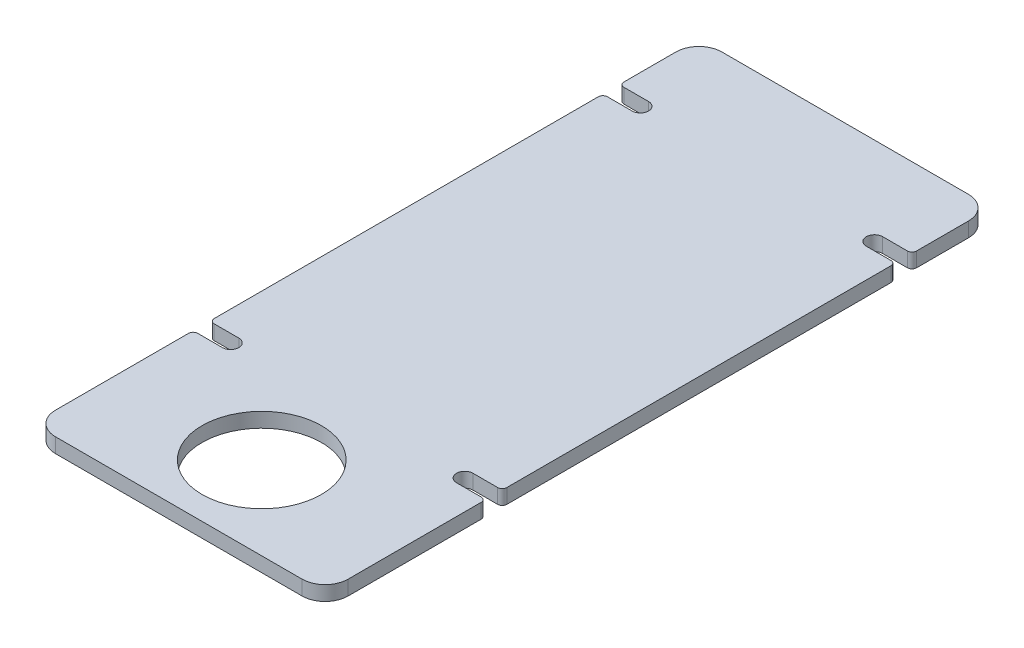
ISO-10303-21;
HEADER;
FILE_DESCRIPTION(('STEP AP214'),'2;1');
FILE_NAME('part.step','',(''),(''),'','','');
FILE_SCHEMA(('AUTOMOTIVE_DESIGN { 1 0 10303 214 1 1 1 1 }'));
ENDSEC;
DATA;
#1=APPLICATION_CONTEXT('core data for automotive mechanical design processes');
#2=APPLICATION_PROTOCOL_DEFINITION('international standard','automotive_design',2000,#1);
#3=PRODUCT_CONTEXT('',#1,'mechanical');
#4=PRODUCT('Part','Part','',(#3));
#5=PRODUCT_RELATED_PRODUCT_CATEGORY('part','',(#4));
#6=PRODUCT_DEFINITION_FORMATION('','',#4);
#7=PRODUCT_DEFINITION_CONTEXT('part definition',#1,'design');
#8=PRODUCT_DEFINITION('design','',#6,#7);
#9=PRODUCT_DEFINITION_SHAPE('','',#8);
#10=(LENGTH_UNIT() NAMED_UNIT(*) SI_UNIT(.MILLI.,.METRE.));
#11=(NAMED_UNIT(*) PLANE_ANGLE_UNIT() SI_UNIT($,.RADIAN.));
#12=(NAMED_UNIT(*) SI_UNIT($,.STERADIAN.) SOLID_ANGLE_UNIT());
#13=UNCERTAINTY_MEASURE_WITH_UNIT(LENGTH_MEASURE(1.E-05),#10,'distance_accuracy_value','');
#14=(GEOMETRIC_REPRESENTATION_CONTEXT(3) GLOBAL_UNCERTAINTY_ASSIGNED_CONTEXT((#13)) GLOBAL_UNIT_ASSIGNED_CONTEXT((#10,
#11,#12)) REPRESENTATION_CONTEXT('',''));
#15=CARTESIAN_POINT('',(0.,0.,0.));
#16=DIRECTION('',(0.,0.,1.));
#17=DIRECTION('',(1.,0.,0.));
#18=AXIS2_PLACEMENT_3D('',#15,#16,#17);
#19=CARTESIAN_POINT('',(0.,6.35,0.));
#20=DIRECTION('',(0.,-1.,0.));
#21=DIRECTION('',(0.,0.,-1.));
#22=AXIS2_PLACEMENT_3D('',#19,#20,#21);
#23=PLANE('',#22);
#24=CARTESIAN_POINT('',(0.,6.35,0.));
#25=DIRECTION('',(0.,1.,0.));
#26=DIRECTION('',(0.,0.,1.));
#27=AXIS2_PLACEMENT_3D('',#24,#25,#26);
#28=CIRCLE('',#27,25.9);
#29=CARTESIAN_POINT('',(0.,6.35,25.9));
#30=VERTEX_POINT('',#29);
#31=EDGE_CURVE('E345',#30,#30,#28,.T.);
#32=ORIENTED_EDGE('',*,*,#31,.F.);
#33=EDGE_LOOP('',(#32));
#34=FACE_BOUND('',#33,.T.);
#35=DIRECTION('',(0.,0.,1.));
#36=VECTOR('',#35,1.);
#37=CARTESIAN_POINT('',(-63.5,6.35,36.));
#38=LINE('',#37,#36);
#39=CARTESIAN_POINT('',(-63.5,6.35,-31.728125));
#40=VERTEX_POINT('',#39);
#41=CARTESIAN_POINT('',(-63.5,6.35,26.));
#42=VERTEX_POINT('',#41);
#43=EDGE_CURVE('E355',#40,#42,#38,.T.);
#44=ORIENTED_EDGE('',*,*,#43,.T.);
#45=CARTESIAN_POINT('',(-53.5,6.35,26.));
#46=DIRECTION('',(0.,-1.,0.));
#47=DIRECTION('',(0.,0.,-1.));
#48=AXIS2_PLACEMENT_3D('',#45,#46,#47);
#49=CIRCLE('',#48,10.);
#50=CARTESIAN_POINT('',(-53.5,6.35,36.));
#51=VERTEX_POINT('',#50);
#52=EDGE_CURVE('E468',#42,#51,#49,.F.);
#53=ORIENTED_EDGE('',*,*,#52,.T.);
#54=DIRECTION('',(1.,0.,0.));
#55=VECTOR('',#54,1.);
#56=CARTESIAN_POINT('',(-63.5,6.35,36.));
#57=LINE('',#56,#55);
#58=CARTESIAN_POINT('',(53.5,6.35,36.));
#59=VERTEX_POINT('',#58);
#60=EDGE_CURVE('E353',#51,#59,#57,.T.);
#61=ORIENTED_EDGE('',*,*,#60,.T.);
#62=CARTESIAN_POINT('',(53.5,6.35,26.));
#63=DIRECTION('',(0.,-1.,0.));
#64=DIRECTION('',(0.,0.,-1.));
#65=AXIS2_PLACEMENT_3D('',#62,#63,#64);
#66=CIRCLE('',#65,10.);
#67=CARTESIAN_POINT('',(63.5,6.35,26.));
#68=VERTEX_POINT('',#67);
#69=EDGE_CURVE('E466',#59,#68,#66,.F.);
#70=ORIENTED_EDGE('',*,*,#69,.T.);
#71=DIRECTION('',(0.,0.,-1.));
#72=VECTOR('',#71,1.);
#73=CARTESIAN_POINT('',(63.5,6.35,36.));
#74=LINE('',#73,#72);
#75=CARTESIAN_POINT('',(63.5,6.35,-31.728125));
#76=VERTEX_POINT('',#75);
#77=EDGE_CURVE('E359',#68,#76,#74,.T.);
#78=ORIENTED_EDGE('',*,*,#77,.T.);
#79=CARTESIAN_POINT('',(61.5,6.35,-31.728125));
#80=DIRECTION('',(0.,-1.,0.));
#81=DIRECTION('',(0.,0.,-1.));
#82=AXIS2_PLACEMENT_3D('',#79,#80,#81);
#83=CIRCLE('',#82,2.);
#84=CARTESIAN_POINT('',(61.5,6.35,-33.728125));
#85=VERTEX_POINT('',#84);
#86=EDGE_CURVE('E392',#76,#85,#83,.F.);
#87=ORIENTED_EDGE('',*,*,#86,.T.);
#88=DIRECTION('',(-1.,0.,0.));
#89=VECTOR('',#88,1.);
#90=CARTESIAN_POINT('',(76.2,6.35,-33.728125));
#91=LINE('',#90,#89);
#92=CARTESIAN_POINT('',(50.8,6.35,-33.728125));
#93=VERTEX_POINT('',#92);
#94=EDGE_CURVE('E275',#85,#93,#91,.T.);
#95=ORIENTED_EDGE('',*,*,#94,.T.);
#96=CARTESIAN_POINT('',(50.8,6.35,-37.3));
#97=DIRECTION('',(0.,-1.,0.));
#98=DIRECTION('',(0.,0.,1.));
#99=AXIS2_PLACEMENT_3D('',#96,#97,#98);
#100=CIRCLE('',#99,3.571875);
#101=CARTESIAN_POINT('',(50.8,6.35,-40.871875));
#102=VERTEX_POINT('',#101);
#103=EDGE_CURVE('E265',#93,#102,#100,.T.);
#104=ORIENTED_EDGE('',*,*,#103,.T.);
#105=DIRECTION('',(1.,0.,0.));
#106=VECTOR('',#105,1.);
#107=CARTESIAN_POINT('',(76.2,6.35,-40.871875));
#108=LINE('',#107,#106);
#109=CARTESIAN_POINT('',(61.5,6.35,-40.871875));
#110=VERTEX_POINT('',#109);
#111=EDGE_CURVE('E272',#102,#110,#108,.T.);
#112=ORIENTED_EDGE('',*,*,#111,.T.);
#113=CARTESIAN_POINT('',(61.5,6.35,-42.871875));
#114=DIRECTION('',(0.,-1.,0.));
#115=DIRECTION('',(0.,0.,-1.));
#116=AXIS2_PLACEMENT_3D('',#113,#114,#115);
#117=CIRCLE('',#116,2.);
#118=CARTESIAN_POINT('',(63.5,6.35,-42.871875));
#119=VERTEX_POINT('',#118);
#120=EDGE_CURVE('E390',#110,#119,#117,.F.);
#121=ORIENTED_EDGE('',*,*,#120,.T.);
#122=CARTESIAN_POINT('',(63.5,6.35,-209.528125));
#123=VERTEX_POINT('',#122);
#124=EDGE_CURVE('E362',#119,#123,#74,.T.);
#125=ORIENTED_EDGE('',*,*,#124,.T.);
#126=CARTESIAN_POINT('',(61.5,6.35,-209.528125));
#127=DIRECTION('',(0.,-1.,0.));
#128=DIRECTION('',(0.,0.,-1.));
#129=AXIS2_PLACEMENT_3D('',#126,#127,#128);
#130=CIRCLE('',#129,2.);
#131=CARTESIAN_POINT('',(61.5,6.35,-211.528125));
#132=VERTEX_POINT('',#131);
#133=EDGE_CURVE('E388',#123,#132,#130,.F.);
#134=ORIENTED_EDGE('',*,*,#133,.T.);
#135=DIRECTION('',(-1.,0.,0.));
#136=VECTOR('',#135,1.);
#137=CARTESIAN_POINT('',(76.2,6.35,-211.528125));
#138=LINE('',#137,#136);
#139=CARTESIAN_POINT('',(50.8,6.35,-211.528125));
#140=VERTEX_POINT('',#139);
#141=EDGE_CURVE('E287',#132,#140,#138,.T.);
#142=ORIENTED_EDGE('',*,*,#141,.T.);
#143=CARTESIAN_POINT('',(50.8,6.35,-215.1));
#144=DIRECTION('',(0.,-1.,0.));
#145=DIRECTION('',(0.,0.,1.));
#146=AXIS2_PLACEMENT_3D('',#143,#144,#145);
#147=CIRCLE('',#146,3.571875);
#148=CARTESIAN_POINT('',(50.8,6.35,-218.671875));
#149=VERTEX_POINT('',#148);
#150=EDGE_CURVE('E294',#140,#149,#147,.T.);
#151=ORIENTED_EDGE('',*,*,#150,.T.);
#152=DIRECTION('',(1.,0.,0.));
#153=VECTOR('',#152,1.);
#154=CARTESIAN_POINT('',(76.2,6.35,-218.671875));
#155=LINE('',#154,#153);
#156=CARTESIAN_POINT('',(61.5,6.35,-218.671875));
#157=VERTEX_POINT('',#156);
#158=EDGE_CURVE('E281',#149,#157,#155,.T.);
#159=ORIENTED_EDGE('',*,*,#158,.T.);
#160=CARTESIAN_POINT('',(61.5,6.35,-220.671875));
#161=DIRECTION('',(0.,-1.,0.));
#162=DIRECTION('',(0.,0.,-1.));
#163=AXIS2_PLACEMENT_3D('',#160,#161,#162);
#164=CIRCLE('',#163,2.);
#165=CARTESIAN_POINT('',(63.5,6.35,-220.671875));
#166=VERTEX_POINT('',#165);
#167=EDGE_CURVE('E386',#157,#166,#164,.F.);
#168=ORIENTED_EDGE('',*,*,#167,.T.);
#169=CARTESIAN_POINT('',(63.5,6.35,-243.2));
#170=VERTEX_POINT('',#169);
#171=EDGE_CURVE('E358',#166,#170,#74,.T.);
#172=ORIENTED_EDGE('',*,*,#171,.T.);
#173=CARTESIAN_POINT('',(53.5,6.35,-243.2));
#174=DIRECTION('',(0.,-1.,0.));
#175=DIRECTION('',(0.,0.,-1.));
#176=AXIS2_PLACEMENT_3D('',#173,#174,#175);
#177=CIRCLE('',#176,10.);
#178=CARTESIAN_POINT('',(53.5,6.35,-253.2));
#179=VERTEX_POINT('',#178);
#180=EDGE_CURVE('E464',#170,#179,#177,.F.);
#181=ORIENTED_EDGE('',*,*,#180,.T.);
#182=DIRECTION('',(-1.,0.,0.));
#183=VECTOR('',#182,1.);
#184=CARTESIAN_POINT('',(-63.5,6.35,-253.2));
#185=LINE('',#184,#183);
#186=CARTESIAN_POINT('',(-53.5,6.35,-253.2));
#187=VERTEX_POINT('',#186);
#188=EDGE_CURVE('E361',#179,#187,#185,.T.);
#189=ORIENTED_EDGE('',*,*,#188,.T.);
#190=CARTESIAN_POINT('',(-53.5,6.35,-243.2));
#191=DIRECTION('',(0.,-1.,0.));
#192=DIRECTION('',(0.,0.,-1.));
#193=AXIS2_PLACEMENT_3D('',#190,#191,#192);
#194=CIRCLE('',#193,10.);
#195=CARTESIAN_POINT('',(-63.5,6.35,-243.2));
#196=VERTEX_POINT('',#195);
#197=EDGE_CURVE('E49',#187,#196,#194,.F.);
#198=ORIENTED_EDGE('',*,*,#197,.T.);
#199=CARTESIAN_POINT('',(-63.5,6.35,-220.671875));
#200=VERTEX_POINT('',#199);
#201=EDGE_CURVE('E351',#196,#200,#38,.T.);
#202=ORIENTED_EDGE('',*,*,#201,.T.);
#203=CARTESIAN_POINT('',(-61.5,6.35,-220.671875));
#204=DIRECTION('',(0.,-1.,0.));
#205=DIRECTION('',(0.,0.,-1.));
#206=AXIS2_PLACEMENT_3D('',#203,#204,#205);
#207=CIRCLE('',#206,2.);
#208=CARTESIAN_POINT('',(-61.5,6.35,-218.671875));
#209=VERTEX_POINT('',#208);
#210=EDGE_CURVE('E382',#200,#209,#207,.F.);
#211=ORIENTED_EDGE('',*,*,#210,.T.);
#212=DIRECTION('',(-1.,0.,0.));
#213=VECTOR('',#212,1.);
#214=CARTESIAN_POINT('',(-76.2,6.35,-218.671875));
#215=LINE('',#214,#213);
#216=CARTESIAN_POINT('',(-50.8,6.35,-218.671875));
#217=VERTEX_POINT('',#216);
#218=EDGE_CURVE('E327',#217,#209,#215,.T.);
#219=ORIENTED_EDGE('',*,*,#218,.F.);
#220=CARTESIAN_POINT('',(-50.8,6.35,-215.1));
#221=DIRECTION('',(0.,1.,0.));
#222=DIRECTION('',(0.,0.,1.));
#223=AXIS2_PLACEMENT_3D('',#220,#221,#222);
#224=CIRCLE('',#223,3.571875);
#225=CARTESIAN_POINT('',(-50.8,6.35,-211.528125));
#226=VERTEX_POINT('',#225);
#227=EDGE_CURVE('E335',#226,#217,#224,.T.);
#228=ORIENTED_EDGE('',*,*,#227,.F.);
#229=DIRECTION('',(1.,0.,0.));
#230=VECTOR('',#229,1.);
#231=CARTESIAN_POINT('',(-76.2,6.35,-211.528125));
#232=LINE('',#231,#230);
#233=CARTESIAN_POINT('',(-61.5,6.35,-211.528125));
#234=VERTEX_POINT('',#233);
#235=EDGE_CURVE('E322',#234,#226,#232,.T.);
#236=ORIENTED_EDGE('',*,*,#235,.F.);
#237=CARTESIAN_POINT('',(-61.5,6.35,-209.528125));
#238=DIRECTION('',(0.,-1.,0.));
#239=DIRECTION('',(0.,0.,-1.));
#240=AXIS2_PLACEMENT_3D('',#237,#238,#239);
#241=CIRCLE('',#240,2.);
#242=CARTESIAN_POINT('',(-63.5,6.35,-209.528125));
#243=VERTEX_POINT('',#242);
#244=EDGE_CURVE('E384',#234,#243,#241,.F.);
#245=ORIENTED_EDGE('',*,*,#244,.T.);
#246=CARTESIAN_POINT('',(-63.5,6.35,-42.871875));
#247=VERTEX_POINT('',#246);
#248=EDGE_CURVE('E354',#243,#247,#38,.T.);
#249=ORIENTED_EDGE('',*,*,#248,.T.);
#250=CARTESIAN_POINT('',(-61.5,6.35,-42.871875));
#251=DIRECTION('',(0.,-1.,0.));
#252=DIRECTION('',(0.,0.,-1.));
#253=AXIS2_PLACEMENT_3D('',#250,#251,#252);
#254=CIRCLE('',#253,2.);
#255=CARTESIAN_POINT('',(-61.5,6.35,-40.871875));
#256=VERTEX_POINT('',#255);
#257=EDGE_CURVE('E396',#247,#256,#254,.F.);
#258=ORIENTED_EDGE('',*,*,#257,.T.);
#259=DIRECTION('',(-1.,0.,0.));
#260=VECTOR('',#259,1.);
#261=CARTESIAN_POINT('',(-76.2,6.35,-40.871875));
#262=LINE('',#261,#260);
#263=CARTESIAN_POINT('',(-50.8,6.35,-40.871875));
#264=VERTEX_POINT('',#263);
#265=EDGE_CURVE('E315',#264,#256,#262,.T.);
#266=ORIENTED_EDGE('',*,*,#265,.F.);
#267=CARTESIAN_POINT('',(-50.8,6.35,-37.3));
#268=DIRECTION('',(0.,1.,0.));
#269=DIRECTION('',(0.,0.,1.));
#270=AXIS2_PLACEMENT_3D('',#267,#268,#269);
#271=CIRCLE('',#270,3.571875);
#272=CARTESIAN_POINT('',(-50.8,6.35,-33.728125));
#273=VERTEX_POINT('',#272);
#274=EDGE_CURVE('E301',#273,#264,#271,.T.);
#275=ORIENTED_EDGE('',*,*,#274,.F.);
#276=DIRECTION('',(1.,0.,0.));
#277=VECTOR('',#276,1.);
#278=CARTESIAN_POINT('',(-76.2,6.35,-33.728125));
#279=LINE('',#278,#277);
#280=CARTESIAN_POINT('',(-61.5,6.35,-33.728125));
#281=VERTEX_POINT('',#280);
#282=EDGE_CURVE('E307',#281,#273,#279,.T.);
#283=ORIENTED_EDGE('',*,*,#282,.F.);
#284=CARTESIAN_POINT('',(-61.5,6.35,-31.728125));
#285=DIRECTION('',(0.,-1.,0.));
#286=DIRECTION('',(0.,0.,-1.));
#287=AXIS2_PLACEMENT_3D('',#284,#285,#286);
#288=CIRCLE('',#287,2.);
#289=EDGE_CURVE('E394',#281,#40,#288,.F.);
#290=ORIENTED_EDGE('',*,*,#289,.T.);
#291=EDGE_LOOP('',(#44,#53,#61,#70,#78,#87,#95,#104,#112,#121,#125,#134,#142,#151,#159,#168,
#172,#181,#189,#198,#202,#211,#219,#228,#236,#245,#249,#258,#266,#275,#283,#290));
#292=FACE_BOUND('',#291,.T.);
#293=ADVANCED_FACE('F34',(#34,#292),#23,.F.);
#294=CARTESIAN_POINT('',(0.,0.,0.));
#295=DIRECTION('',(0.,-1.,0.));
#296=DIRECTION('',(0.,0.,-1.));
#297=AXIS2_PLACEMENT_3D('',#294,#295,#296);
#298=PLANE('',#297);
#299=CARTESIAN_POINT('',(0.,0.,0.));
#300=DIRECTION('',(0.,1.,0.));
#301=DIRECTION('',(0.,0.,1.));
#302=AXIS2_PLACEMENT_3D('',#299,#300,#301);
#303=CIRCLE('',#302,25.9);
#304=CARTESIAN_POINT('',(0.,0.,25.9));
#305=VERTEX_POINT('',#304);
#306=EDGE_CURVE('E342',#305,#305,#303,.T.);
#307=ORIENTED_EDGE('',*,*,#306,.T.);
#308=EDGE_LOOP('',(#307));
#309=FACE_BOUND('',#308,.T.);
#310=DIRECTION('',(1.,0.,0.));
#311=VECTOR('',#310,1.);
#312=CARTESIAN_POINT('',(-63.5,0.,36.));
#313=LINE('',#312,#311);
#314=CARTESIAN_POINT('',(-53.5,0.,36.));
#315=VERTEX_POINT('',#314);
#316=CARTESIAN_POINT('',(53.5,0.,36.));
#317=VERTEX_POINT('',#316);
#318=EDGE_CURVE('E367',#315,#317,#313,.T.);
#319=ORIENTED_EDGE('',*,*,#318,.F.);
#320=CARTESIAN_POINT('',(-53.5,0.,26.));
#321=DIRECTION('',(0.,-1.,0.));
#322=DIRECTION('',(0.,0.,-1.));
#323=AXIS2_PLACEMENT_3D('',#320,#321,#322);
#324=CIRCLE('',#323,10.);
#325=CARTESIAN_POINT('',(-63.5,0.,26.));
#326=VERTEX_POINT('',#325);
#327=EDGE_CURVE('E459',#315,#326,#324,.T.);
#328=ORIENTED_EDGE('',*,*,#327,.T.);
#329=DIRECTION('',(0.,0.,1.));
#330=VECTOR('',#329,1.);
#331=CARTESIAN_POINT('',(-63.5,0.,36.));
#332=LINE('',#331,#330);
#333=CARTESIAN_POINT('',(-63.5,0.,-31.728125));
#334=VERTEX_POINT('',#333);
#335=EDGE_CURVE('E348',#334,#326,#332,.T.);
#336=ORIENTED_EDGE('',*,*,#335,.F.);
#337=CARTESIAN_POINT('',(-61.5,0.,-31.728125));
#338=DIRECTION('',(0.,-1.,0.));
#339=DIRECTION('',(0.,0.,-1.));
#340=AXIS2_PLACEMENT_3D('',#337,#338,#339);
#341=CIRCLE('',#340,2.);
#342=CARTESIAN_POINT('',(-61.5,0.,-33.728125));
#343=VERTEX_POINT('',#342);
#344=EDGE_CURVE('E413',#334,#343,#341,.T.);
#345=ORIENTED_EDGE('',*,*,#344,.T.);
#346=DIRECTION('',(1.,0.,0.));
#347=VECTOR('',#346,1.);
#348=CARTESIAN_POINT('',(-76.2,0.,-33.728125));
#349=LINE('',#348,#347);
#350=CARTESIAN_POINT('',(-50.8,0.,-33.728125));
#351=VERTEX_POINT('',#350);
#352=EDGE_CURVE('E310',#343,#351,#349,.T.);
#353=ORIENTED_EDGE('',*,*,#352,.T.);
#354=CARTESIAN_POINT('',(-50.8,0.,-37.3));
#355=DIRECTION('',(0.,1.,0.));
#356=DIRECTION('',(0.,0.,1.));
#357=AXIS2_PLACEMENT_3D('',#354,#355,#356);
#358=CIRCLE('',#357,3.571875);
#359=CARTESIAN_POINT('',(-50.8,0.,-40.871875));
#360=VERTEX_POINT('',#359);
#361=EDGE_CURVE('E303',#351,#360,#358,.T.);
#362=ORIENTED_EDGE('',*,*,#361,.T.);
#363=DIRECTION('',(-1.,0.,0.));
#364=VECTOR('',#363,1.);
#365=CARTESIAN_POINT('',(-76.2,0.,-40.871875));
#366=LINE('',#365,#364);
#367=CARTESIAN_POINT('',(-61.5,0.,-40.871875));
#368=VERTEX_POINT('',#367);
#369=EDGE_CURVE('E306',#360,#368,#366,.T.);
#370=ORIENTED_EDGE('',*,*,#369,.T.);
#371=CARTESIAN_POINT('',(-61.5,0.,-42.871875));
#372=DIRECTION('',(0.,-1.,0.));
#373=DIRECTION('',(0.,0.,-1.));
#374=AXIS2_PLACEMENT_3D('',#371,#372,#373);
#375=CIRCLE('',#374,2.);
#376=CARTESIAN_POINT('',(-63.5,0.,-42.871875));
#377=VERTEX_POINT('',#376);
#378=EDGE_CURVE('E415',#368,#377,#375,.T.);
#379=ORIENTED_EDGE('',*,*,#378,.T.);
#380=CARTESIAN_POINT('',(-63.5,0.,-209.528125));
#381=VERTEX_POINT('',#380);
#382=EDGE_CURVE('E368',#381,#377,#332,.T.);
#383=ORIENTED_EDGE('',*,*,#382,.F.);
#384=CARTESIAN_POINT('',(-61.5,0.,-209.528125));
#385=DIRECTION('',(0.,-1.,0.));
#386=DIRECTION('',(0.,0.,-1.));
#387=AXIS2_PLACEMENT_3D('',#384,#385,#386);
#388=CIRCLE('',#387,2.);
#389=CARTESIAN_POINT('',(-61.5,0.,-211.528125));
#390=VERTEX_POINT('',#389);
#391=EDGE_CURVE('E403',#381,#390,#388,.T.);
#392=ORIENTED_EDGE('',*,*,#391,.T.);
#393=DIRECTION('',(1.,0.,0.));
#394=VECTOR('',#393,1.);
#395=CARTESIAN_POINT('',(-76.2,0.,-211.528125));
#396=LINE('',#395,#394);
#397=CARTESIAN_POINT('',(-50.8,0.,-211.528125));
#398=VERTEX_POINT('',#397);
#399=EDGE_CURVE('E324',#390,#398,#396,.T.);
#400=ORIENTED_EDGE('',*,*,#399,.T.);
#401=CARTESIAN_POINT('',(-50.8,0.,-215.1));
#402=DIRECTION('',(0.,1.,0.));
#403=DIRECTION('',(0.,0.,1.));
#404=AXIS2_PLACEMENT_3D('',#401,#402,#403);
#405=CIRCLE('',#404,3.571875);
#406=CARTESIAN_POINT('',(-50.8,0.,-218.671875));
#407=VERTEX_POINT('',#406);
#408=EDGE_CURVE('E326',#398,#407,#405,.T.);
#409=ORIENTED_EDGE('',*,*,#408,.T.);
#410=DIRECTION('',(-1.,0.,0.));
#411=VECTOR('',#410,1.);
#412=CARTESIAN_POINT('',(-76.2,0.,-218.671875));
#413=LINE('',#412,#411);
#414=CARTESIAN_POINT('',(-61.5,0.,-218.671875));
#415=VERTEX_POINT('',#414);
#416=EDGE_CURVE('E330',#407,#415,#413,.T.);
#417=ORIENTED_EDGE('',*,*,#416,.T.);
#418=CARTESIAN_POINT('',(-61.5,0.,-220.671875));
#419=DIRECTION('',(0.,-1.,0.));
#420=DIRECTION('',(0.,0.,-1.));
#421=AXIS2_PLACEMENT_3D('',#418,#419,#420);
#422=CIRCLE('',#421,2.);
#423=CARTESIAN_POINT('',(-63.5,0.,-220.671875));
#424=VERTEX_POINT('',#423);
#425=EDGE_CURVE('E400',#415,#424,#422,.T.);
#426=ORIENTED_EDGE('',*,*,#425,.T.);
#427=CARTESIAN_POINT('',(-63.5,0.,-243.2));
#428=VERTEX_POINT('',#427);
#429=EDGE_CURVE('E365',#428,#424,#332,.T.);
#430=ORIENTED_EDGE('',*,*,#429,.F.);
#431=CARTESIAN_POINT('',(-53.5,0.,-243.2));
#432=DIRECTION('',(0.,-1.,0.));
#433=DIRECTION('',(0.,0.,-1.));
#434=AXIS2_PLACEMENT_3D('',#431,#432,#433);
#435=CIRCLE('',#434,10.);
#436=CARTESIAN_POINT('',(-53.5,0.,-253.2));
#437=VERTEX_POINT('',#436);
#438=EDGE_CURVE('E453',#428,#437,#435,.T.);
#439=ORIENTED_EDGE('',*,*,#438,.T.);
#440=DIRECTION('',(-1.,0.,0.));
#441=VECTOR('',#440,1.);
#442=CARTESIAN_POINT('',(-63.5,0.,-253.2));
#443=LINE('',#442,#441);
#444=CARTESIAN_POINT('',(53.5,0.,-253.2));
#445=VERTEX_POINT('',#444);
#446=EDGE_CURVE('E374',#445,#437,#443,.T.);
#447=ORIENTED_EDGE('',*,*,#446,.F.);
#448=CARTESIAN_POINT('',(53.5,0.,-243.2));
#449=DIRECTION('',(0.,-1.,0.));
#450=DIRECTION('',(0.,0.,-1.));
#451=AXIS2_PLACEMENT_3D('',#448,#449,#450);
#452=CIRCLE('',#451,10.);
#453=CARTESIAN_POINT('',(63.5,0.,-243.2));
#454=VERTEX_POINT('',#453);
#455=EDGE_CURVE('E455',#445,#454,#452,.T.);
#456=ORIENTED_EDGE('',*,*,#455,.T.);
#457=DIRECTION('',(0.,0.,-1.));
#458=VECTOR('',#457,1.);
#459=CARTESIAN_POINT('',(63.5,0.,36.));
#460=LINE('',#459,#458);
#461=CARTESIAN_POINT('',(63.5,0.,-220.671875));
#462=VERTEX_POINT('',#461);
#463=EDGE_CURVE('E371',#462,#454,#460,.T.);
#464=ORIENTED_EDGE('',*,*,#463,.F.);
#465=CARTESIAN_POINT('',(61.5,0.,-220.671875));
#466=DIRECTION('',(0.,-1.,0.));
#467=DIRECTION('',(0.,0.,-1.));
#468=AXIS2_PLACEMENT_3D('',#465,#466,#467);
#469=CIRCLE('',#468,2.);
#470=CARTESIAN_POINT('',(61.5,0.,-218.671875));
#471=VERTEX_POINT('',#470);
#472=EDGE_CURVE('E405',#462,#471,#469,.T.);
#473=ORIENTED_EDGE('',*,*,#472,.T.);
#474=DIRECTION('',(1.,0.,0.));
#475=VECTOR('',#474,1.);
#476=CARTESIAN_POINT('',(76.2,0.,-218.671875));
#477=LINE('',#476,#475);
#478=CARTESIAN_POINT('',(50.8,0.,-218.671875));
#479=VERTEX_POINT('',#478);
#480=EDGE_CURVE('E283',#479,#471,#477,.T.);
#481=ORIENTED_EDGE('',*,*,#480,.F.);
#482=CARTESIAN_POINT('',(50.8,0.,-215.1));
#483=DIRECTION('',(0.,-1.,0.));
#484=DIRECTION('',(0.,0.,1.));
#485=AXIS2_PLACEMENT_3D('',#482,#483,#484);
#486=CIRCLE('',#485,3.571875);
#487=CARTESIAN_POINT('',(50.8,0.,-211.528125));
#488=VERTEX_POINT('',#487);
#489=EDGE_CURVE('E286',#488,#479,#486,.T.);
#490=ORIENTED_EDGE('',*,*,#489,.F.);
#491=DIRECTION('',(-1.,0.,0.));
#492=VECTOR('',#491,1.);
#493=CARTESIAN_POINT('',(76.2,0.,-211.528125));
#494=LINE('',#493,#492);
#495=CARTESIAN_POINT('',(61.5,0.,-211.528125));
#496=VERTEX_POINT('',#495);
#497=EDGE_CURVE('E289',#496,#488,#494,.T.);
#498=ORIENTED_EDGE('',*,*,#497,.F.);
#499=CARTESIAN_POINT('',(61.5,0.,-209.528125));
#500=DIRECTION('',(0.,-1.,0.));
#501=DIRECTION('',(0.,0.,-1.));
#502=AXIS2_PLACEMENT_3D('',#499,#500,#501);
#503=CIRCLE('',#502,2.);
#504=CARTESIAN_POINT('',(63.5,0.,-209.528125));
#505=VERTEX_POINT('',#504);
#506=EDGE_CURVE('E407',#496,#505,#503,.T.);
#507=ORIENTED_EDGE('',*,*,#506,.T.);
#508=CARTESIAN_POINT('',(63.5,0.,-42.871875));
#509=VERTEX_POINT('',#508);
#510=EDGE_CURVE('E375',#509,#505,#460,.T.);
#511=ORIENTED_EDGE('',*,*,#510,.F.);
#512=CARTESIAN_POINT('',(61.5,0.,-42.871875));
#513=DIRECTION('',(0.,-1.,0.));
#514=DIRECTION('',(0.,0.,-1.));
#515=AXIS2_PLACEMENT_3D('',#512,#513,#514);
#516=CIRCLE('',#515,2.);
#517=CARTESIAN_POINT('',(61.5,0.,-40.871875));
#518=VERTEX_POINT('',#517);
#519=EDGE_CURVE('E409',#509,#518,#516,.T.);
#520=ORIENTED_EDGE('',*,*,#519,.T.);
#521=DIRECTION('',(1.,0.,0.));
#522=VECTOR('',#521,1.);
#523=CARTESIAN_POINT('',(76.2,0.,-40.871875));
#524=LINE('',#523,#522);
#525=CARTESIAN_POINT('',(50.8,0.,-40.871875));
#526=VERTEX_POINT('',#525);
#527=EDGE_CURVE('E257',#526,#518,#524,.T.);
#528=ORIENTED_EDGE('',*,*,#527,.F.);
#529=CARTESIAN_POINT('',(50.8,0.,-37.3));
#530=DIRECTION('',(0.,-1.,0.));
#531=DIRECTION('',(0.,0.,1.));
#532=AXIS2_PLACEMENT_3D('',#529,#530,#531);
#533=CIRCLE('',#532,3.571875);
#534=CARTESIAN_POINT('',(50.8,0.,-33.728125));
#535=VERTEX_POINT('',#534);
#536=EDGE_CURVE('E258',#535,#526,#533,.T.);
#537=ORIENTED_EDGE('',*,*,#536,.F.);
#538=DIRECTION('',(-1.,0.,0.));
#539=VECTOR('',#538,1.);
#540=CARTESIAN_POINT('',(76.2,0.,-33.728125));
#541=LINE('',#540,#539);
#542=CARTESIAN_POINT('',(61.5,0.,-33.728125));
#543=VERTEX_POINT('',#542);
#544=EDGE_CURVE('E246',#543,#535,#541,.T.);
#545=ORIENTED_EDGE('',*,*,#544,.F.);
#546=CARTESIAN_POINT('',(61.5,0.,-31.728125));
#547=DIRECTION('',(0.,-1.,0.));
#548=DIRECTION('',(0.,0.,-1.));
#549=AXIS2_PLACEMENT_3D('',#546,#547,#548);
#550=CIRCLE('',#549,2.);
#551=CARTESIAN_POINT('',(63.5,0.,-31.728125));
#552=VERTEX_POINT('',#551);
#553=EDGE_CURVE('E411',#543,#552,#550,.T.);
#554=ORIENTED_EDGE('',*,*,#553,.T.);
#555=CARTESIAN_POINT('',(63.5,0.,26.));
#556=VERTEX_POINT('',#555);
#557=EDGE_CURVE('E372',#556,#552,#460,.T.);
#558=ORIENTED_EDGE('',*,*,#557,.F.);
#559=CARTESIAN_POINT('',(53.5,0.,26.));
#560=DIRECTION('',(0.,-1.,0.));
#561=DIRECTION('',(0.,0.,-1.));
#562=AXIS2_PLACEMENT_3D('',#559,#560,#561);
#563=CIRCLE('',#562,10.);
#564=EDGE_CURVE('E457',#556,#317,#563,.T.);
#565=ORIENTED_EDGE('',*,*,#564,.T.);
#566=EDGE_LOOP('',(#319,#328,#336,#345,#353,#362,#370,#379,#383,#392,#400,#409,#417,#426,#430,
#439,#447,#456,#464,#473,#481,#490,#498,#507,#511,#520,#528,#537,#545,#554,#558,#565));
#567=FACE_BOUND('',#566,.T.);
#568=ADVANCED_FACE('F270',(#309,#567),#298,.T.);
#569=CARTESIAN_POINT('',(63.5,6.35,36.));
#570=DIRECTION('',(-1.,0.,0.));
#571=DIRECTION('',(0.,0.,1.));
#572=AXIS2_PLACEMENT_3D('',#569,#570,#571);
#573=PLANE('',#572);
#574=ORIENTED_EDGE('',*,*,#124,.F.);
#575=DIRECTION('',(0.,1.,0.));
#576=VECTOR('',#575,1.);
#577=CARTESIAN_POINT('',(63.5,0.,-42.871875));
#578=LINE('',#577,#576);
#579=EDGE_CURVE('E431',#119,#509,#578,.F.);
#580=ORIENTED_EDGE('',*,*,#579,.T.);
#581=ORIENTED_EDGE('',*,*,#510,.T.);
#582=DIRECTION('',(0.,-1.,0.));
#583=VECTOR('',#582,1.);
#584=CARTESIAN_POINT('',(63.5,6.35,-209.528125));
#585=LINE('',#584,#583);
#586=EDGE_CURVE('E429',#505,#123,#585,.F.);
#587=ORIENTED_EDGE('',*,*,#586,.T.);
#588=EDGE_LOOP('',(#574,#580,#581,#587));
#589=FACE_BOUND('',#588,.T.);
#590=ADVANCED_FACE('F566',(#589),#573,.F.);
#591=ORIENTED_EDGE('',*,*,#77,.F.);
#592=DIRECTION('',(0.,-1.,0.));
#593=VECTOR('',#592,1.);
#594=CARTESIAN_POINT('',(63.5,6.35,26.));
#595=LINE('',#594,#593);
#596=EDGE_CURVE('E470',#68,#556,#595,.T.);
#597=ORIENTED_EDGE('',*,*,#596,.T.);
#598=ORIENTED_EDGE('',*,*,#557,.T.);
#599=DIRECTION('',(0.,-1.,0.));
#600=VECTOR('',#599,1.);
#601=CARTESIAN_POINT('',(63.5,6.35,-31.728125));
#602=LINE('',#601,#600);
#603=EDGE_CURVE('E423',#552,#76,#602,.F.);
#604=ORIENTED_EDGE('',*,*,#603,.T.);
#605=EDGE_LOOP('',(#591,#597,#598,#604));
#606=FACE_BOUND('',#605,.T.);
#607=ADVANCED_FACE('F548',(#606),#573,.F.);
#608=ORIENTED_EDGE('',*,*,#463,.T.);
#609=DIRECTION('',(0.,-1.,0.));
#610=VECTOR('',#609,1.);
#611=CARTESIAN_POINT('',(63.5,6.35,-243.2));
#612=LINE('',#611,#610);
#613=EDGE_CURVE('E42',#454,#170,#612,.F.);
#614=ORIENTED_EDGE('',*,*,#613,.T.);
#615=ORIENTED_EDGE('',*,*,#171,.F.);
#616=DIRECTION('',(0.,1.,0.));
#617=VECTOR('',#616,1.);
#618=CARTESIAN_POINT('',(63.5,0.,-220.671875));
#619=LINE('',#618,#617);
#620=EDGE_CURVE('E439',#166,#462,#619,.F.);
#621=ORIENTED_EDGE('',*,*,#620,.T.);
#622=EDGE_LOOP('',(#608,#614,#615,#621));
#623=FACE_BOUND('',#622,.T.);
#624=ADVANCED_FACE('F481',(#623),#573,.F.);
#625=CARTESIAN_POINT('',(-63.5,6.35,36.));
#626=DIRECTION('',(1.,0.,0.));
#627=DIRECTION('',(0.,0.,-1.));
#628=AXIS2_PLACEMENT_3D('',#625,#626,#627);
#629=PLANE('',#628);
#630=ORIENTED_EDGE('',*,*,#335,.T.);
#631=DIRECTION('',(0.,-1.,0.));
#632=VECTOR('',#631,1.);
#633=CARTESIAN_POINT('',(-63.5,6.35,26.));
#634=LINE('',#633,#632);
#635=EDGE_CURVE('E461',#326,#42,#634,.F.);
#636=ORIENTED_EDGE('',*,*,#635,.T.);
#637=ORIENTED_EDGE('',*,*,#43,.F.);
#638=DIRECTION('',(0.,-1.,0.));
#639=VECTOR('',#638,1.);
#640=CARTESIAN_POINT('',(-63.5,6.35,-31.728125));
#641=LINE('',#640,#639);
#642=EDGE_CURVE('E417',#40,#334,#641,.T.);
#643=ORIENTED_EDGE('',*,*,#642,.T.);
#644=EDGE_LOOP('',(#630,#636,#637,#643));
#645=FACE_BOUND('',#644,.T.);
#646=ADVANCED_FACE('F531',(#645),#629,.F.);
#647=ORIENTED_EDGE('',*,*,#201,.F.);
#648=DIRECTION('',(0.,-1.,0.));
#649=VECTOR('',#648,1.);
#650=CARTESIAN_POINT('',(-63.5,6.35,-243.2));
#651=LINE('',#650,#649);
#652=EDGE_CURVE('E11',#196,#428,#651,.T.);
#653=ORIENTED_EDGE('',*,*,#652,.T.);
#654=ORIENTED_EDGE('',*,*,#429,.T.);
#655=DIRECTION('',(0.,1.,0.));
#656=VECTOR('',#655,1.);
#657=CARTESIAN_POINT('',(-63.5,6.35,-220.671875));
#658=LINE('',#657,#656);
#659=EDGE_CURVE('E443',#424,#200,#658,.T.);
#660=ORIENTED_EDGE('',*,*,#659,.T.);
#661=EDGE_LOOP('',(#647,#653,#654,#660));
#662=FACE_BOUND('',#661,.T.);
#663=ADVANCED_FACE('F495',(#662),#629,.F.);
#664=ORIENTED_EDGE('',*,*,#382,.T.);
#665=DIRECTION('',(0.,1.,0.));
#666=VECTOR('',#665,1.);
#667=CARTESIAN_POINT('',(-63.5,6.35,-42.871875));
#668=LINE('',#667,#666);
#669=EDGE_CURVE('E379',#377,#247,#668,.T.);
#670=ORIENTED_EDGE('',*,*,#669,.T.);
#671=ORIENTED_EDGE('',*,*,#248,.F.);
#672=DIRECTION('',(0.,-1.,0.));
#673=VECTOR('',#672,1.);
#674=CARTESIAN_POINT('',(-63.5,6.35,-209.528125));
#675=LINE('',#674,#673);
#676=EDGE_CURVE('E364',#243,#381,#675,.T.);
#677=ORIENTED_EDGE('',*,*,#676,.T.);
#678=EDGE_LOOP('',(#664,#670,#671,#677));
#679=FACE_BOUND('',#678,.T.);
#680=ADVANCED_FACE('F524',(#679),#629,.F.);
#681=CARTESIAN_POINT('',(-63.5,6.35,36.));
#682=DIRECTION('',(0.,0.,-1.));
#683=DIRECTION('',(-1.,0.,0.));
#684=AXIS2_PLACEMENT_3D('',#681,#682,#683);
#685=PLANE('',#684);
#686=ORIENTED_EDGE('',*,*,#60,.F.);
#687=DIRECTION('',(0.,-1.,0.));
#688=VECTOR('',#687,1.);
#689=CARTESIAN_POINT('',(-53.5,6.35,36.));
#690=LINE('',#689,#688);
#691=EDGE_CURVE('E450',#51,#315,#690,.T.);
#692=ORIENTED_EDGE('',*,*,#691,.T.);
#693=ORIENTED_EDGE('',*,*,#318,.T.);
#694=DIRECTION('',(0.,-1.,0.));
#695=VECTOR('',#694,1.);
#696=CARTESIAN_POINT('',(53.5,6.35,36.));
#697=LINE('',#696,#695);
#698=EDGE_CURVE('E448',#317,#59,#697,.F.);
#699=ORIENTED_EDGE('',*,*,#698,.T.);
#700=EDGE_LOOP('',(#686,#692,#693,#699));
#701=FACE_BOUND('',#700,.T.);
#702=ADVANCED_FACE('F541',(#701),#685,.F.);
#703=CARTESIAN_POINT('',(-63.5,6.35,-253.2));
#704=DIRECTION('',(0.,0.,1.));
#705=DIRECTION('',(1.,0.,0.));
#706=AXIS2_PLACEMENT_3D('',#703,#704,#705);
#707=PLANE('',#706);
#708=ORIENTED_EDGE('',*,*,#188,.F.);
#709=DIRECTION('',(0.,-1.,0.));
#710=VECTOR('',#709,1.);
#711=CARTESIAN_POINT('',(53.5,6.35,-253.2));
#712=LINE('',#711,#710);
#713=EDGE_CURVE('E474',#179,#445,#712,.T.);
#714=ORIENTED_EDGE('',*,*,#713,.T.);
#715=ORIENTED_EDGE('',*,*,#446,.T.);
#716=DIRECTION('',(0.,-1.,0.));
#717=VECTOR('',#716,1.);
#718=CARTESIAN_POINT('',(-53.5,6.35,-253.2));
#719=LINE('',#718,#717);
#720=EDGE_CURVE('E57',#437,#187,#719,.F.);
#721=ORIENTED_EDGE('',*,*,#720,.T.);
#722=EDGE_LOOP('',(#708,#714,#715,#721));
#723=FACE_BOUND('',#722,.T.);
#724=ADVANCED_FACE('F490',(#723),#707,.F.);
#725=CARTESIAN_POINT('',(0.,6.35,0.));
#726=DIRECTION('',(0.,-1.,0.));
#727=DIRECTION('',(0.,0.,-1.));
#728=AXIS2_PLACEMENT_3D('',#725,#726,#727);
#729=CYLINDRICAL_SURFACE('',#728,25.9);
#730=ORIENTED_EDGE('',*,*,#31,.T.);
#731=EDGE_LOOP('',(#730));
#732=FACE_BOUND('',#731,.T.);
#733=ORIENTED_EDGE('',*,*,#306,.F.);
#734=EDGE_LOOP('',(#733));
#735=FACE_BOUND('',#734,.T.);
#736=ADVANCED_FACE('F608',(#732,#735),#729,.F.);
#737=CARTESIAN_POINT('',(-76.2,0.,-218.671875));
#738=DIRECTION('',(0.,0.,-1.));
#739=DIRECTION('',(-1.,0.,0.));
#740=AXIS2_PLACEMENT_3D('',#737,#738,#739);
#741=PLANE('',#740);
#742=ORIENTED_EDGE('',*,*,#218,.T.);
#743=DIRECTION('',(0.,1.,0.));
#744=VECTOR('',#743,1.);
#745=CARTESIAN_POINT('',(-61.5,0.,-218.671875));
#746=LINE('',#745,#744);
#747=EDGE_CURVE('E446',#209,#415,#746,.F.);
#748=ORIENTED_EDGE('',*,*,#747,.T.);
#749=ORIENTED_EDGE('',*,*,#416,.F.);
#750=DIRECTION('',(0.,1.,0.));
#751=VECTOR('',#750,1.);
#752=CARTESIAN_POINT('',(-50.8,0.,-218.671875));
#753=LINE('',#752,#751);
#754=EDGE_CURVE('E340',#407,#217,#753,.T.);
#755=ORIENTED_EDGE('',*,*,#754,.T.);
#756=EDGE_LOOP('',(#742,#748,#749,#755));
#757=FACE_BOUND('',#756,.T.);
#758=ADVANCED_FACE('F505',(#757),#741,.F.);
#759=CARTESIAN_POINT('',(-76.2,0.,-211.528125));
#760=DIRECTION('',(0.,0.,1.));
#761=DIRECTION('',(1.,0.,0.));
#762=AXIS2_PLACEMENT_3D('',#759,#760,#761);
#763=PLANE('',#762);
#764=ORIENTED_EDGE('',*,*,#399,.F.);
#765=DIRECTION('',(0.,-1.,0.));
#766=VECTOR('',#765,1.);
#767=CARTESIAN_POINT('',(-61.5,0.,-211.528125));
#768=LINE('',#767,#766);
#769=EDGE_CURVE('E441',#390,#234,#768,.F.);
#770=ORIENTED_EDGE('',*,*,#769,.T.);
#771=ORIENTED_EDGE('',*,*,#235,.T.);
#772=DIRECTION('',(0.,1.,0.));
#773=VECTOR('',#772,1.);
#774=CARTESIAN_POINT('',(-50.8,0.,-211.528125));
#775=LINE('',#774,#773);
#776=EDGE_CURVE('E333',#398,#226,#775,.T.);
#777=ORIENTED_EDGE('',*,*,#776,.F.);
#778=EDGE_LOOP('',(#764,#770,#771,#777));
#779=FACE_BOUND('',#778,.T.);
#780=ADVANCED_FACE('F756',(#779),#763,.F.);
#781=CARTESIAN_POINT('',(-50.8,0.,-215.1));
#782=DIRECTION('',(0.,1.,0.));
#783=DIRECTION('',(0.,0.,1.));
#784=AXIS2_PLACEMENT_3D('',#781,#782,#783);
#785=CYLINDRICAL_SURFACE('',#784,3.571875);
#786=ORIENTED_EDGE('',*,*,#227,.T.);
#787=ORIENTED_EDGE('',*,*,#754,.F.);
#788=ORIENTED_EDGE('',*,*,#408,.F.);
#789=ORIENTED_EDGE('',*,*,#776,.T.);
#790=EDGE_LOOP('',(#786,#787,#788,#789));
#791=FACE_BOUND('',#790,.T.);
#792=ADVANCED_FACE('F510',(#791),#785,.F.);
#793=CARTESIAN_POINT('',(-76.2,0.,-33.728125));
#794=DIRECTION('',(0.,0.,1.));
#795=DIRECTION('',(1.,0.,0.));
#796=AXIS2_PLACEMENT_3D('',#793,#794,#795);
#797=PLANE('',#796);
#798=ORIENTED_EDGE('',*,*,#352,.F.);
#799=DIRECTION('',(0.,-1.,0.));
#800=VECTOR('',#799,1.);
#801=CARTESIAN_POINT('',(-61.5,0.,-33.728125));
#802=LINE('',#801,#800);
#803=EDGE_CURVE('E420',#343,#281,#802,.F.);
#804=ORIENTED_EDGE('',*,*,#803,.T.);
#805=ORIENTED_EDGE('',*,*,#282,.T.);
#806=DIRECTION('',(0.,1.,0.));
#807=VECTOR('',#806,1.);
#808=CARTESIAN_POINT('',(-50.8,0.,-33.728125));
#809=LINE('',#808,#807);
#810=EDGE_CURVE('E319',#351,#273,#809,.T.);
#811=ORIENTED_EDGE('',*,*,#810,.F.);
#812=EDGE_LOOP('',(#798,#804,#805,#811));
#813=FACE_BOUND('',#812,.T.);
#814=ADVANCED_FACE('F768',(#813),#797,.F.);
#815=CARTESIAN_POINT('',(-76.2,0.,-40.871875));
#816=DIRECTION('',(0.,0.,-1.));
#817=DIRECTION('',(-1.,0.,0.));
#818=AXIS2_PLACEMENT_3D('',#815,#816,#817);
#819=PLANE('',#818);
#820=ORIENTED_EDGE('',*,*,#265,.T.);
#821=DIRECTION('',(0.,1.,0.));
#822=VECTOR('',#821,1.);
#823=CARTESIAN_POINT('',(-61.5,0.,-40.871875));
#824=LINE('',#823,#822);
#825=EDGE_CURVE('E398',#256,#368,#824,.F.);
#826=ORIENTED_EDGE('',*,*,#825,.T.);
#827=ORIENTED_EDGE('',*,*,#369,.F.);
#828=DIRECTION('',(0.,1.,0.));
#829=VECTOR('',#828,1.);
#830=CARTESIAN_POINT('',(-50.8,0.,-40.871875));
#831=LINE('',#830,#829);
#832=EDGE_CURVE('E312',#360,#264,#831,.T.);
#833=ORIENTED_EDGE('',*,*,#832,.T.);
#834=EDGE_LOOP('',(#820,#826,#827,#833));
#835=FACE_BOUND('',#834,.T.);
#836=ADVANCED_FACE('F775',(#835),#819,.F.);
#837=CARTESIAN_POINT('',(-50.8,0.,-37.3));
#838=DIRECTION('',(0.,1.,0.));
#839=DIRECTION('',(0.,0.,1.));
#840=AXIS2_PLACEMENT_3D('',#837,#838,#839);
#841=CYLINDRICAL_SURFACE('',#840,3.571875);
#842=ORIENTED_EDGE('',*,*,#274,.T.);
#843=ORIENTED_EDGE('',*,*,#832,.F.);
#844=ORIENTED_EDGE('',*,*,#361,.F.);
#845=ORIENTED_EDGE('',*,*,#810,.T.);
#846=EDGE_LOOP('',(#842,#843,#844,#845));
#847=FACE_BOUND('',#846,.T.);
#848=ADVANCED_FACE('F783',(#847),#841,.F.);
#849=CARTESIAN_POINT('',(76.2,0.,-211.528125));
#850=DIRECTION('',(0.,0.,-1.));
#851=DIRECTION('',(-1.,0.,0.));
#852=AXIS2_PLACEMENT_3D('',#849,#850,#851);
#853=PLANE('',#852);
#854=ORIENTED_EDGE('',*,*,#141,.F.);
#855=DIRECTION('',(0.,-1.,0.));
#856=VECTOR('',#855,1.);
#857=CARTESIAN_POINT('',(61.5,0.,-211.528125));
#858=LINE('',#857,#856);
#859=EDGE_CURVE('E433',#132,#496,#858,.T.);
#860=ORIENTED_EDGE('',*,*,#859,.T.);
#861=ORIENTED_EDGE('',*,*,#497,.T.);
#862=DIRECTION('',(0.,1.,0.));
#863=VECTOR('',#862,1.);
#864=CARTESIAN_POINT('',(50.8,0.,-211.528125));
#865=LINE('',#864,#863);
#866=EDGE_CURVE('E298',#488,#140,#865,.T.);
#867=ORIENTED_EDGE('',*,*,#866,.T.);
#868=EDGE_LOOP('',(#854,#860,#861,#867));
#869=FACE_BOUND('',#868,.T.);
#870=ADVANCED_FACE('F576',(#869),#853,.T.);
#871=CARTESIAN_POINT('',(76.2,0.,-218.671875));
#872=DIRECTION('',(0.,0.,1.));
#873=DIRECTION('',(1.,0.,0.));
#874=AXIS2_PLACEMENT_3D('',#871,#872,#873);
#875=PLANE('',#874);
#876=ORIENTED_EDGE('',*,*,#480,.T.);
#877=DIRECTION('',(0.,1.,0.));
#878=VECTOR('',#877,1.);
#879=CARTESIAN_POINT('',(61.5,6.35,-218.671875));
#880=LINE('',#879,#878);
#881=EDGE_CURVE('E436',#471,#157,#880,.T.);
#882=ORIENTED_EDGE('',*,*,#881,.T.);
#883=ORIENTED_EDGE('',*,*,#158,.F.);
#884=DIRECTION('',(0.,1.,0.));
#885=VECTOR('',#884,1.);
#886=CARTESIAN_POINT('',(50.8,0.,-218.671875));
#887=LINE('',#886,#885);
#888=EDGE_CURVE('E291',#479,#149,#887,.T.);
#889=ORIENTED_EDGE('',*,*,#888,.F.);
#890=EDGE_LOOP('',(#876,#882,#883,#889));
#891=FACE_BOUND('',#890,.T.);
#892=ADVANCED_FACE('F585',(#891),#875,.T.);
#893=CARTESIAN_POINT('',(50.8,0.,-215.1));
#894=DIRECTION('',(0.,1.,0.));
#895=DIRECTION('',(0.,0.,1.));
#896=AXIS2_PLACEMENT_3D('',#893,#894,#895);
#897=CYLINDRICAL_SURFACE('',#896,3.571875);
#898=ORIENTED_EDGE('',*,*,#150,.F.);
#899=ORIENTED_EDGE('',*,*,#866,.F.);
#900=ORIENTED_EDGE('',*,*,#489,.T.);
#901=ORIENTED_EDGE('',*,*,#888,.T.);
#902=EDGE_LOOP('',(#898,#899,#900,#901));
#903=FACE_BOUND('',#902,.T.);
#904=ADVANCED_FACE('F581',(#903),#897,.F.);
#905=CARTESIAN_POINT('',(76.2,0.,-40.871875));
#906=DIRECTION('',(0.,0.,1.));
#907=DIRECTION('',(1.,0.,0.));
#908=AXIS2_PLACEMENT_3D('',#905,#906,#907);
#909=PLANE('',#908);
#910=ORIENTED_EDGE('',*,*,#527,.T.);
#911=DIRECTION('',(0.,1.,0.));
#912=VECTOR('',#911,1.);
#913=CARTESIAN_POINT('',(61.5,6.35,-40.871875));
#914=LINE('',#913,#912);
#915=EDGE_CURVE('E426',#518,#110,#914,.T.);
#916=ORIENTED_EDGE('',*,*,#915,.T.);
#917=ORIENTED_EDGE('',*,*,#111,.F.);
#918=DIRECTION('',(0.,1.,0.));
#919=VECTOR('',#918,1.);
#920=CARTESIAN_POINT('',(50.8,0.,-40.871875));
#921=LINE('',#920,#919);
#922=EDGE_CURVE('E266',#526,#102,#921,.T.);
#923=ORIENTED_EDGE('',*,*,#922,.F.);
#924=EDGE_LOOP('',(#910,#916,#917,#923));
#925=FACE_BOUND('',#924,.T.);
#926=ADVANCED_FACE('F557',(#925),#909,.T.);
#927=CARTESIAN_POINT('',(76.2,0.,-33.728125));
#928=DIRECTION('',(0.,0.,-1.));
#929=DIRECTION('',(-1.,0.,0.));
#930=AXIS2_PLACEMENT_3D('',#927,#928,#929);
#931=PLANE('',#930);
#932=ORIENTED_EDGE('',*,*,#94,.F.);
#933=DIRECTION('',(0.,-1.,0.));
#934=VECTOR('',#933,1.);
#935=CARTESIAN_POINT('',(61.5,0.,-33.728125));
#936=LINE('',#935,#934);
#937=EDGE_CURVE('E253',#85,#543,#936,.T.);
#938=ORIENTED_EDGE('',*,*,#937,.T.);
#939=ORIENTED_EDGE('',*,*,#544,.T.);
#940=DIRECTION('',(0.,1.,0.));
#941=VECTOR('',#940,1.);
#942=CARTESIAN_POINT('',(50.8,0.,-33.728125));
#943=LINE('',#942,#941);
#944=EDGE_CURVE('E250',#535,#93,#943,.T.);
#945=ORIENTED_EDGE('',*,*,#944,.T.);
#946=EDGE_LOOP('',(#932,#938,#939,#945));
#947=FACE_BOUND('',#946,.T.);
#948=ADVANCED_FACE('F249',(#947),#931,.T.);
#949=CARTESIAN_POINT('',(50.8,0.,-37.3));
#950=DIRECTION('',(0.,1.,0.));
#951=DIRECTION('',(0.,0.,1.));
#952=AXIS2_PLACEMENT_3D('',#949,#950,#951);
#953=CYLINDRICAL_SURFACE('',#952,3.571875);
#954=ORIENTED_EDGE('',*,*,#103,.F.);
#955=ORIENTED_EDGE('',*,*,#944,.F.);
#956=ORIENTED_EDGE('',*,*,#536,.T.);
#957=ORIENTED_EDGE('',*,*,#922,.T.);
#958=EDGE_LOOP('',(#954,#955,#956,#957));
#959=FACE_BOUND('',#958,.T.);
#960=ADVANCED_FACE('F261',(#959),#953,.F.);
#961=CARTESIAN_POINT('',(-61.5,6.35,-42.871875));
#962=DIRECTION('',(0.,1.,0.));
#963=DIRECTION('',(0.,0.,1.));
#964=AXIS2_PLACEMENT_3D('',#961,#962,#963);
#965=CYLINDRICAL_SURFACE('',#964,2.);
#966=ORIENTED_EDGE('',*,*,#378,.F.);
#967=ORIENTED_EDGE('',*,*,#825,.F.);
#968=ORIENTED_EDGE('',*,*,#257,.F.);
#969=ORIENTED_EDGE('',*,*,#669,.F.);
#970=EDGE_LOOP('',(#966,#967,#968,#969));
#971=FACE_BOUND('',#970,.T.);
#972=ADVANCED_FACE('F619',(#971),#965,.T.);
#973=CARTESIAN_POINT('',(-61.5,6.35,-31.728125));
#974=DIRECTION('',(0.,-1.,0.));
#975=DIRECTION('',(0.,0.,-1.));
#976=AXIS2_PLACEMENT_3D('',#973,#974,#975);
#977=CYLINDRICAL_SURFACE('',#976,2.);
#978=ORIENTED_EDGE('',*,*,#289,.F.);
#979=ORIENTED_EDGE('',*,*,#803,.F.);
#980=ORIENTED_EDGE('',*,*,#344,.F.);
#981=ORIENTED_EDGE('',*,*,#642,.F.);
#982=EDGE_LOOP('',(#978,#979,#980,#981));
#983=FACE_BOUND('',#982,.T.);
#984=ADVANCED_FACE('F622',(#983),#977,.T.);
#985=CARTESIAN_POINT('',(61.5,0.,-31.728125));
#986=DIRECTION('',(0.,1.,0.));
#987=DIRECTION('',(0.,0.,1.));
#988=AXIS2_PLACEMENT_3D('',#985,#986,#987);
#989=CYLINDRICAL_SURFACE('',#988,2.);
#990=ORIENTED_EDGE('',*,*,#86,.F.);
#991=ORIENTED_EDGE('',*,*,#603,.F.);
#992=ORIENTED_EDGE('',*,*,#553,.F.);
#993=ORIENTED_EDGE('',*,*,#937,.F.);
#994=EDGE_LOOP('',(#990,#991,#992,#993));
#995=FACE_BOUND('',#994,.T.);
#996=ADVANCED_FACE('F553',(#995),#989,.T.);
#997=CARTESIAN_POINT('',(61.5,0.,-42.871875));
#998=DIRECTION('',(0.,-1.,0.));
#999=DIRECTION('',(0.,0.,-1.));
#1000=AXIS2_PLACEMENT_3D('',#997,#998,#999);
#1001=CYLINDRICAL_SURFACE('',#1000,2.);
#1002=ORIENTED_EDGE('',*,*,#519,.F.);
#1003=ORIENTED_EDGE('',*,*,#579,.F.);
#1004=ORIENTED_EDGE('',*,*,#120,.F.);
#1005=ORIENTED_EDGE('',*,*,#915,.F.);
#1006=EDGE_LOOP('',(#1002,#1003,#1004,#1005));
#1007=FACE_BOUND('',#1006,.T.);
#1008=ADVANCED_FACE('F561',(#1007),#1001,.T.);
#1009=CARTESIAN_POINT('',(61.5,0.,-209.528125));
#1010=DIRECTION('',(0.,1.,0.));
#1011=DIRECTION('',(0.,0.,1.));
#1012=AXIS2_PLACEMENT_3D('',#1009,#1010,#1011);
#1013=CYLINDRICAL_SURFACE('',#1012,2.);
#1014=ORIENTED_EDGE('',*,*,#133,.F.);
#1015=ORIENTED_EDGE('',*,*,#586,.F.);
#1016=ORIENTED_EDGE('',*,*,#506,.F.);
#1017=ORIENTED_EDGE('',*,*,#859,.F.);
#1018=EDGE_LOOP('',(#1014,#1015,#1016,#1017));
#1019=FACE_BOUND('',#1018,.T.);
#1020=ADVANCED_FACE('F573',(#1019),#1013,.T.);
#1021=CARTESIAN_POINT('',(61.5,0.,-220.671875));
#1022=DIRECTION('',(0.,-1.,0.));
#1023=DIRECTION('',(0.,0.,-1.));
#1024=AXIS2_PLACEMENT_3D('',#1021,#1022,#1023);
#1025=CYLINDRICAL_SURFACE('',#1024,2.);
#1026=ORIENTED_EDGE('',*,*,#472,.F.);
#1027=ORIENTED_EDGE('',*,*,#620,.F.);
#1028=ORIENTED_EDGE('',*,*,#167,.F.);
#1029=ORIENTED_EDGE('',*,*,#881,.F.);
#1030=EDGE_LOOP('',(#1026,#1027,#1028,#1029));
#1031=FACE_BOUND('',#1030,.T.);
#1032=ADVANCED_FACE('F589',(#1031),#1025,.T.);
#1033=CARTESIAN_POINT('',(-61.5,6.35,-209.528125));
#1034=DIRECTION('',(0.,-1.,0.));
#1035=DIRECTION('',(0.,0.,-1.));
#1036=AXIS2_PLACEMENT_3D('',#1033,#1034,#1035);
#1037=CYLINDRICAL_SURFACE('',#1036,2.);
#1038=ORIENTED_EDGE('',*,*,#244,.F.);
#1039=ORIENTED_EDGE('',*,*,#769,.F.);
#1040=ORIENTED_EDGE('',*,*,#391,.F.);
#1041=ORIENTED_EDGE('',*,*,#676,.F.);
#1042=EDGE_LOOP('',(#1038,#1039,#1040,#1041));
#1043=FACE_BOUND('',#1042,.T.);
#1044=ADVANCED_FACE('F520',(#1043),#1037,.T.);
#1045=CARTESIAN_POINT('',(-61.5,6.35,-220.671875));
#1046=DIRECTION('',(0.,1.,0.));
#1047=DIRECTION('',(0.,0.,1.));
#1048=AXIS2_PLACEMENT_3D('',#1045,#1046,#1047);
#1049=CYLINDRICAL_SURFACE('',#1048,2.);
#1050=ORIENTED_EDGE('',*,*,#425,.F.);
#1051=ORIENTED_EDGE('',*,*,#747,.F.);
#1052=ORIENTED_EDGE('',*,*,#210,.F.);
#1053=ORIENTED_EDGE('',*,*,#659,.F.);
#1054=EDGE_LOOP('',(#1050,#1051,#1052,#1053));
#1055=FACE_BOUND('',#1054,.T.);
#1056=ADVANCED_FACE('F502',(#1055),#1049,.T.);
#1057=CARTESIAN_POINT('',(-53.5,6.35,26.));
#1058=DIRECTION('',(0.,-1.,0.));
#1059=DIRECTION('',(0.,0.,-1.));
#1060=AXIS2_PLACEMENT_3D('',#1057,#1058,#1059);
#1061=CYLINDRICAL_SURFACE('',#1060,10.);
#1062=ORIENTED_EDGE('',*,*,#52,.F.);
#1063=ORIENTED_EDGE('',*,*,#635,.F.);
#1064=ORIENTED_EDGE('',*,*,#327,.F.);
#1065=ORIENTED_EDGE('',*,*,#691,.F.);
#1066=EDGE_LOOP('',(#1062,#1063,#1064,#1065));
#1067=FACE_BOUND('',#1066,.T.);
#1068=ADVANCED_FACE('F536',(#1067),#1061,.T.);
#1069=CARTESIAN_POINT('',(53.5,6.35,26.));
#1070=DIRECTION('',(0.,-1.,0.));
#1071=DIRECTION('',(0.,0.,-1.));
#1072=AXIS2_PLACEMENT_3D('',#1069,#1070,#1071);
#1073=CYLINDRICAL_SURFACE('',#1072,10.);
#1074=ORIENTED_EDGE('',*,*,#69,.F.);
#1075=ORIENTED_EDGE('',*,*,#698,.F.);
#1076=ORIENTED_EDGE('',*,*,#564,.F.);
#1077=ORIENTED_EDGE('',*,*,#596,.F.);
#1078=EDGE_LOOP('',(#1074,#1075,#1076,#1077));
#1079=FACE_BOUND('',#1078,.T.);
#1080=ADVANCED_FACE('F544',(#1079),#1073,.T.);
#1081=CARTESIAN_POINT('',(53.5,6.35,-243.2));
#1082=DIRECTION('',(0.,-1.,0.));
#1083=DIRECTION('',(0.,0.,-1.));
#1084=AXIS2_PLACEMENT_3D('',#1081,#1082,#1083);
#1085=CYLINDRICAL_SURFACE('',#1084,10.);
#1086=ORIENTED_EDGE('',*,*,#180,.F.);
#1087=ORIENTED_EDGE('',*,*,#613,.F.);
#1088=ORIENTED_EDGE('',*,*,#455,.F.);
#1089=ORIENTED_EDGE('',*,*,#713,.F.);
#1090=EDGE_LOOP('',(#1086,#1087,#1088,#1089));
#1091=FACE_BOUND('',#1090,.T.);
#1092=ADVANCED_FACE('F488',(#1091),#1085,.T.);
#1093=CARTESIAN_POINT('',(-53.5,6.35,-243.2));
#1094=DIRECTION('',(0.,-1.,0.));
#1095=DIRECTION('',(0.,0.,-1.));
#1096=AXIS2_PLACEMENT_3D('',#1093,#1094,#1095);
#1097=CYLINDRICAL_SURFACE('',#1096,10.);
#1098=ORIENTED_EDGE('',*,*,#197,.F.);
#1099=ORIENTED_EDGE('',*,*,#720,.F.);
#1100=ORIENTED_EDGE('',*,*,#438,.F.);
#1101=ORIENTED_EDGE('',*,*,#652,.F.);
#1102=EDGE_LOOP('',(#1098,#1099,#1100,#1101));
#1103=FACE_BOUND('',#1102,.T.);
#1104=ADVANCED_FACE('F36',(#1103),#1097,.T.);
#1105=CLOSED_SHELL('',(#293,#568,#590,#607,#624,#646,#663,#680,#702,#724,#736,#758,#780,#792,
#814,#836,#848,#870,#892,#904,#926,#948,#960,#972,#984,#996,#1008,#1020,#1032,#1044,#1056,#1068,
#1080,#1092,#1104));
#1106=MANIFOLD_SOLID_BREP('B2',#1105);
#1107=ADVANCED_BREP_SHAPE_REPRESENTATION('',(#18,#1106),#14);
#1108=SHAPE_DEFINITION_REPRESENTATION(#9,#1107);
ENDSEC;
END-ISO-10303-21;
